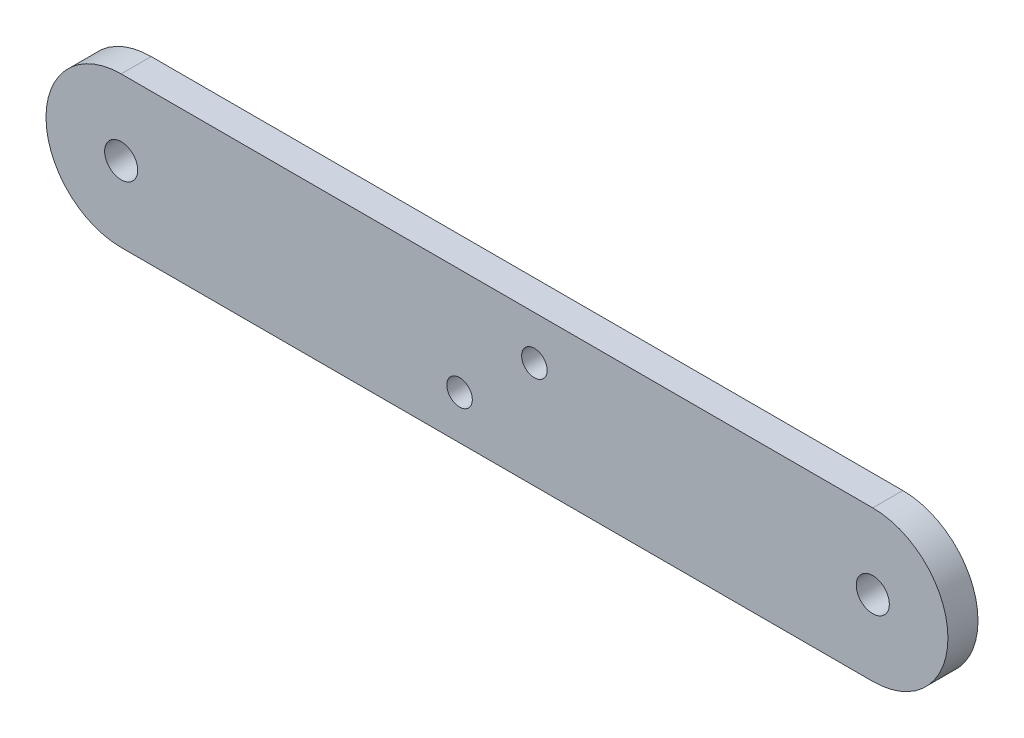
ISO-10303-21;
HEADER;
FILE_DESCRIPTION(('STEP AP214'),'2;1');
FILE_NAME('part.step','',(''),(''),'','','');
FILE_SCHEMA(('AUTOMOTIVE_DESIGN { 1 0 10303 214 1 1 1 1 }'));
ENDSEC;
DATA;
#1=APPLICATION_CONTEXT('core data for automotive mechanical design processes');
#2=APPLICATION_PROTOCOL_DEFINITION('international standard','automotive_design',2000,#1);
#3=PRODUCT_CONTEXT('',#1,'mechanical');
#4=PRODUCT('Part','Part','',(#3));
#5=PRODUCT_RELATED_PRODUCT_CATEGORY('part','',(#4));
#6=PRODUCT_DEFINITION_FORMATION('','',#4);
#7=PRODUCT_DEFINITION_CONTEXT('part definition',#1,'design');
#8=PRODUCT_DEFINITION('design','',#6,#7);
#9=PRODUCT_DEFINITION_SHAPE('','',#8);
#10=(LENGTH_UNIT() NAMED_UNIT(*) SI_UNIT(.MILLI.,.METRE.));
#11=(NAMED_UNIT(*) PLANE_ANGLE_UNIT() SI_UNIT($,.RADIAN.));
#12=(NAMED_UNIT(*) SI_UNIT($,.STERADIAN.) SOLID_ANGLE_UNIT());
#13=UNCERTAINTY_MEASURE_WITH_UNIT(LENGTH_MEASURE(1.E-05),#10,'distance_accuracy_value','');
#14=(GEOMETRIC_REPRESENTATION_CONTEXT(3) GLOBAL_UNCERTAINTY_ASSIGNED_CONTEXT((#13)) GLOBAL_UNIT_ASSIGNED_CONTEXT((#10,
#11,#12)) REPRESENTATION_CONTEXT('',''));
#15=CARTESIAN_POINT('',(0.,0.,0.));
#16=DIRECTION('',(0.,0.,1.));
#17=DIRECTION('',(1.,0.,0.));
#18=AXIS2_PLACEMENT_3D('',#15,#16,#17);
#19=CARTESIAN_POINT('',(0.,0.,4.));
#20=DIRECTION('',(0.,0.,1.));
#21=DIRECTION('',(1.,0.,0.));
#22=AXIS2_PLACEMENT_3D('',#19,#20,#21);
#23=PLANE('',#22);
#24=CARTESIAN_POINT('',(54.9792888802734,4.17811946296252,4.));
#25=DIRECTION('',(0.,0.,1.));
#26=DIRECTION('',(1.,0.,0.));
#27=AXIS2_PLACEMENT_3D('',#24,#25,#26);
#28=CIRCLE('',#27,1.7);
#29=CARTESIAN_POINT('',(56.6792888802734,4.17811946296252,4.));
#30=VERTEX_POINT('',#29);
#31=EDGE_CURVE('E125',#30,#30,#28,.T.);
#32=ORIENTED_EDGE('',*,*,#31,.F.);
#33=EDGE_LOOP('',(#32));
#34=FACE_BOUND('',#33,.T.);
#35=CARTESIAN_POINT('',(0.,0.,4.));
#36=DIRECTION('',(0.,0.,1.));
#37=DIRECTION('',(1.,0.,0.));
#38=AXIS2_PLACEMENT_3D('',#35,#36,#37);
#39=CIRCLE('',#38,2.2);
#40=CARTESIAN_POINT('',(2.2,0.,4.));
#41=VERTEX_POINT('',#40);
#42=EDGE_CURVE('E104',#41,#41,#39,.T.);
#43=ORIENTED_EDGE('',*,*,#42,.F.);
#44=EDGE_LOOP('',(#43));
#45=FACE_BOUND('',#44,.T.);
#46=CARTESIAN_POINT('',(0.,0.,4.));
#47=DIRECTION('',(0.,0.,1.));
#48=DIRECTION('',(1.,0.,0.));
#49=AXIS2_PLACEMENT_3D('',#46,#47,#48);
#50=CIRCLE('',#49,10.);
#51=CARTESIAN_POINT('',(0.,10.,4.));
#52=VERTEX_POINT('',#51);
#53=CARTESIAN_POINT('',(0.,-10.,4.));
#54=VERTEX_POINT('',#53);
#55=EDGE_CURVE('E89',#52,#54,#50,.T.);
#56=ORIENTED_EDGE('',*,*,#55,.T.);
#57=DIRECTION('',(1.,0.,0.));
#58=VECTOR('',#57,1.);
#59=CARTESIAN_POINT('',(0.,-10.,4.));
#60=LINE('',#59,#58);
#61=CARTESIAN_POINT('',(100.,-10.,4.));
#62=VERTEX_POINT('',#61);
#63=EDGE_CURVE('E84',#54,#62,#60,.T.);
#64=ORIENTED_EDGE('',*,*,#63,.T.);
#65=CARTESIAN_POINT('',(100.,0.,4.));
#66=DIRECTION('',(0.,0.,1.));
#67=DIRECTION('',(1.,0.,0.));
#68=AXIS2_PLACEMENT_3D('',#65,#66,#67);
#69=CIRCLE('',#68,10.);
#70=CARTESIAN_POINT('',(100.,10.,4.));
#71=VERTEX_POINT('',#70);
#72=EDGE_CURVE('E87',#62,#71,#69,.T.);
#73=ORIENTED_EDGE('',*,*,#72,.T.);
#74=DIRECTION('',(-1.,0.,0.));
#75=VECTOR('',#74,1.);
#76=CARTESIAN_POINT('',(0.,10.,4.));
#77=LINE('',#76,#75);
#78=EDGE_CURVE('E54',#71,#52,#77,.T.);
#79=ORIENTED_EDGE('',*,*,#78,.T.);
#80=EDGE_LOOP('',(#56,#64,#73,#79));
#81=FACE_BOUND('',#80,.T.);
#82=CARTESIAN_POINT('',(100.,0.,4.));
#83=DIRECTION('',(0.,0.,1.));
#84=DIRECTION('',(1.,0.,0.));
#85=AXIS2_PLACEMENT_3D('',#82,#83,#84);
#86=CIRCLE('',#85,2.2);
#87=CARTESIAN_POINT('',(102.2,0.,4.));
#88=VERTEX_POINT('',#87);
#89=EDGE_CURVE('E119',#88,#88,#86,.T.);
#90=ORIENTED_EDGE('',*,*,#89,.F.);
#91=EDGE_LOOP('',(#90));
#92=FACE_BOUND('',#91,.T.);
#93=CARTESIAN_POINT('',(45.0207111197266,-4.17811946296252,4.));
#94=DIRECTION('',(0.,0.,1.));
#95=DIRECTION('',(1.,0.,0.));
#96=AXIS2_PLACEMENT_3D('',#93,#94,#95);
#97=CIRCLE('',#96,1.7);
#98=CARTESIAN_POINT('',(46.7207111197267,-4.17811946296252,4.));
#99=VERTEX_POINT('',#98);
#100=EDGE_CURVE('E131',#99,#99,#97,.T.);
#101=ORIENTED_EDGE('',*,*,#100,.F.);
#102=EDGE_LOOP('',(#101));
#103=FACE_BOUND('',#102,.T.);
#104=ADVANCED_FACE('F37',(#34,#45,#81,#92,#103),#23,.T.);
#105=CARTESIAN_POINT('',(0.,0.,0.));
#106=DIRECTION('',(0.,0.,1.));
#107=DIRECTION('',(1.,0.,0.));
#108=AXIS2_PLACEMENT_3D('',#105,#106,#107);
#109=PLANE('',#108);
#110=CARTESIAN_POINT('',(0.,0.,0.));
#111=DIRECTION('',(0.,0.,1.));
#112=DIRECTION('',(1.,0.,0.));
#113=AXIS2_PLACEMENT_3D('',#110,#111,#112);
#114=CIRCLE('',#113,10.);
#115=CARTESIAN_POINT('',(0.,10.,0.));
#116=VERTEX_POINT('',#115);
#117=CARTESIAN_POINT('',(0.,-10.,0.));
#118=VERTEX_POINT('',#117);
#119=EDGE_CURVE('E101',#116,#118,#114,.T.);
#120=ORIENTED_EDGE('',*,*,#119,.F.);
#121=DIRECTION('',(-1.,0.,0.));
#122=VECTOR('',#121,1.);
#123=CARTESIAN_POINT('',(0.,10.,0.));
#124=LINE('',#123,#122);
#125=CARTESIAN_POINT('',(100.,10.,0.));
#126=VERTEX_POINT('',#125);
#127=EDGE_CURVE('E77',#126,#116,#124,.T.);
#128=ORIENTED_EDGE('',*,*,#127,.F.);
#129=CARTESIAN_POINT('',(100.,0.,0.));
#130=DIRECTION('',(0.,0.,1.));
#131=DIRECTION('',(1.,0.,0.));
#132=AXIS2_PLACEMENT_3D('',#129,#130,#131);
#133=CIRCLE('',#132,10.);
#134=CARTESIAN_POINT('',(100.,-10.,0.));
#135=VERTEX_POINT('',#134);
#136=EDGE_CURVE('E71',#135,#126,#133,.T.);
#137=ORIENTED_EDGE('',*,*,#136,.F.);
#138=DIRECTION('',(1.,0.,0.));
#139=VECTOR('',#138,1.);
#140=CARTESIAN_POINT('',(0.,-10.,0.));
#141=LINE('',#140,#139);
#142=EDGE_CURVE('E93',#118,#135,#141,.T.);
#143=ORIENTED_EDGE('',*,*,#142,.F.);
#144=EDGE_LOOP('',(#120,#128,#137,#143));
#145=FACE_BOUND('',#144,.T.);
#146=CARTESIAN_POINT('',(0.,0.,0.));
#147=DIRECTION('',(0.,0.,1.));
#148=DIRECTION('',(1.,0.,0.));
#149=AXIS2_PLACEMENT_3D('',#146,#147,#148);
#150=CIRCLE('',#149,2.2);
#151=CARTESIAN_POINT('',(2.2,0.,0.));
#152=VERTEX_POINT('',#151);
#153=EDGE_CURVE('E116',#152,#152,#150,.T.);
#154=ORIENTED_EDGE('',*,*,#153,.T.);
#155=EDGE_LOOP('',(#154));
#156=FACE_BOUND('',#155,.T.);
#157=CARTESIAN_POINT('',(100.,0.,0.));
#158=DIRECTION('',(0.,0.,1.));
#159=DIRECTION('',(1.,0.,0.));
#160=AXIS2_PLACEMENT_3D('',#157,#158,#159);
#161=CIRCLE('',#160,2.2);
#162=CARTESIAN_POINT('',(102.2,0.,0.));
#163=VERTEX_POINT('',#162);
#164=EDGE_CURVE('E122',#163,#163,#161,.T.);
#165=ORIENTED_EDGE('',*,*,#164,.T.);
#166=EDGE_LOOP('',(#165));
#167=FACE_BOUND('',#166,.T.);
#168=CARTESIAN_POINT('',(54.9792888802734,4.17811946296252,0.));
#169=DIRECTION('',(0.,0.,1.));
#170=DIRECTION('',(1.,0.,0.));
#171=AXIS2_PLACEMENT_3D('',#168,#169,#170);
#172=CIRCLE('',#171,1.7);
#173=CARTESIAN_POINT('',(56.6792888802734,4.17811946296252,0.));
#174=VERTEX_POINT('',#173);
#175=EDGE_CURVE('E128',#174,#174,#172,.T.);
#176=ORIENTED_EDGE('',*,*,#175,.T.);
#177=EDGE_LOOP('',(#176));
#178=FACE_BOUND('',#177,.T.);
#179=CARTESIAN_POINT('',(45.0207111197266,-4.17811946296252,0.));
#180=DIRECTION('',(0.,0.,1.));
#181=DIRECTION('',(1.,0.,0.));
#182=AXIS2_PLACEMENT_3D('',#179,#180,#181);
#183=CIRCLE('',#182,1.7);
#184=CARTESIAN_POINT('',(46.7207111197267,-4.17811946296252,0.));
#185=VERTEX_POINT('',#184);
#186=EDGE_CURVE('E134',#185,#185,#183,.T.);
#187=ORIENTED_EDGE('',*,*,#186,.T.);
#188=EDGE_LOOP('',(#187));
#189=FACE_BOUND('',#188,.T.);
#190=ADVANCED_FACE('F112',(#145,#156,#167,#178,#189),#109,.F.);
#191=CARTESIAN_POINT('',(0.,0.,4.));
#192=DIRECTION('',(0.,0.,-1.));
#193=DIRECTION('',(-1.,0.,0.));
#194=AXIS2_PLACEMENT_3D('',#191,#192,#193);
#195=CYLINDRICAL_SURFACE('',#194,10.);
#196=ORIENTED_EDGE('',*,*,#119,.T.);
#197=DIRECTION('',(0.,0.,-1.));
#198=VECTOR('',#197,1.);
#199=CARTESIAN_POINT('',(0.,-10.,4.));
#200=LINE('',#199,#198);
#201=EDGE_CURVE('E11',#54,#118,#200,.T.);
#202=ORIENTED_EDGE('',*,*,#201,.F.);
#203=ORIENTED_EDGE('',*,*,#55,.F.);
#204=DIRECTION('',(0.,0.,-1.));
#205=VECTOR('',#204,1.);
#206=CARTESIAN_POINT('',(0.,10.,4.));
#207=LINE('',#206,#205);
#208=EDGE_CURVE('E97',#52,#116,#207,.T.);
#209=ORIENTED_EDGE('',*,*,#208,.T.);
#210=EDGE_LOOP('',(#196,#202,#203,#209));
#211=FACE_BOUND('',#210,.T.);
#212=ADVANCED_FACE('F39',(#211),#195,.T.);
#213=CARTESIAN_POINT('',(0.,-10.,4.));
#214=DIRECTION('',(0.,1.,0.));
#215=DIRECTION('',(-1.,0.,0.));
#216=AXIS2_PLACEMENT_3D('',#213,#214,#215);
#217=PLANE('',#216);
#218=ORIENTED_EDGE('',*,*,#142,.T.);
#219=DIRECTION('',(0.,0.,-1.));
#220=VECTOR('',#219,1.);
#221=CARTESIAN_POINT('',(100.,-10.,4.));
#222=LINE('',#221,#220);
#223=EDGE_CURVE('E46',#62,#135,#222,.T.);
#224=ORIENTED_EDGE('',*,*,#223,.F.);
#225=ORIENTED_EDGE('',*,*,#63,.F.);
#226=ORIENTED_EDGE('',*,*,#201,.T.);
#227=EDGE_LOOP('',(#218,#224,#225,#226));
#228=FACE_BOUND('',#227,.T.);
#229=ADVANCED_FACE('F92',(#228),#217,.F.);
#230=CARTESIAN_POINT('',(100.,0.,4.));
#231=DIRECTION('',(0.,0.,-1.));
#232=DIRECTION('',(-1.,0.,0.));
#233=AXIS2_PLACEMENT_3D('',#230,#231,#232);
#234=CYLINDRICAL_SURFACE('',#233,10.);
#235=ORIENTED_EDGE('',*,*,#136,.T.);
#236=DIRECTION('',(0.,0.,-1.));
#237=VECTOR('',#236,1.);
#238=CARTESIAN_POINT('',(100.,10.,4.));
#239=LINE('',#238,#237);
#240=EDGE_CURVE('E94',#71,#126,#239,.T.);
#241=ORIENTED_EDGE('',*,*,#240,.F.);
#242=ORIENTED_EDGE('',*,*,#72,.F.);
#243=ORIENTED_EDGE('',*,*,#223,.T.);
#244=EDGE_LOOP('',(#235,#241,#242,#243));
#245=FACE_BOUND('',#244,.T.);
#246=ADVANCED_FACE('F95',(#245),#234,.T.);
#247=CARTESIAN_POINT('',(0.,10.,4.));
#248=DIRECTION('',(0.,-1.,0.));
#249=DIRECTION('',(1.,0.,0.));
#250=AXIS2_PLACEMENT_3D('',#247,#248,#249);
#251=PLANE('',#250);
#252=ORIENTED_EDGE('',*,*,#127,.T.);
#253=ORIENTED_EDGE('',*,*,#208,.F.);
#254=ORIENTED_EDGE('',*,*,#78,.F.);
#255=ORIENTED_EDGE('',*,*,#240,.T.);
#256=EDGE_LOOP('',(#252,#253,#254,#255));
#257=FACE_BOUND('',#256,.T.);
#258=ADVANCED_FACE('F109',(#257),#251,.F.);
#259=CARTESIAN_POINT('',(0.,0.,4.));
#260=DIRECTION('',(0.,0.,-1.));
#261=DIRECTION('',(-1.,0.,0.));
#262=AXIS2_PLACEMENT_3D('',#259,#260,#261);
#263=CYLINDRICAL_SURFACE('',#262,2.2);
#264=ORIENTED_EDGE('',*,*,#42,.T.);
#265=EDGE_LOOP('',(#264));
#266=FACE_BOUND('',#265,.T.);
#267=ORIENTED_EDGE('',*,*,#153,.F.);
#268=EDGE_LOOP('',(#267));
#269=FACE_BOUND('',#268,.T.);
#270=ADVANCED_FACE('F153',(#266,#269),#263,.F.);
#271=CARTESIAN_POINT('',(100.,0.,4.));
#272=DIRECTION('',(0.,0.,-1.));
#273=DIRECTION('',(-1.,0.,0.));
#274=AXIS2_PLACEMENT_3D('',#271,#272,#273);
#275=CYLINDRICAL_SURFACE('',#274,2.2);
#276=ORIENTED_EDGE('',*,*,#89,.T.);
#277=EDGE_LOOP('',(#276));
#278=FACE_BOUND('',#277,.T.);
#279=ORIENTED_EDGE('',*,*,#164,.F.);
#280=EDGE_LOOP('',(#279));
#281=FACE_BOUND('',#280,.T.);
#282=ADVANCED_FACE('F199',(#278,#281),#275,.F.);
#283=CARTESIAN_POINT('',(54.9792888802734,4.17811946296252,4.));
#284=DIRECTION('',(0.,0.,-1.));
#285=DIRECTION('',(-1.,0.,0.));
#286=AXIS2_PLACEMENT_3D('',#283,#284,#285);
#287=CYLINDRICAL_SURFACE('',#286,1.7);
#288=ORIENTED_EDGE('',*,*,#31,.T.);
#289=EDGE_LOOP('',(#288));
#290=FACE_BOUND('',#289,.T.);
#291=ORIENTED_EDGE('',*,*,#175,.F.);
#292=EDGE_LOOP('',(#291));
#293=FACE_BOUND('',#292,.T.);
#294=ADVANCED_FACE('F207',(#290,#293),#287,.F.);
#295=CARTESIAN_POINT('',(45.0207111197266,-4.17811946296252,4.));
#296=DIRECTION('',(0.,0.,-1.));
#297=DIRECTION('',(-1.,0.,0.));
#298=AXIS2_PLACEMENT_3D('',#295,#296,#297);
#299=CYLINDRICAL_SURFACE('',#298,1.7);
#300=ORIENTED_EDGE('',*,*,#100,.T.);
#301=EDGE_LOOP('',(#300));
#302=FACE_BOUND('',#301,.T.);
#303=ORIENTED_EDGE('',*,*,#186,.F.);
#304=EDGE_LOOP('',(#303));
#305=FACE_BOUND('',#304,.T.);
#306=ADVANCED_FACE('F140',(#302,#305),#299,.F.);
#307=CLOSED_SHELL('',(#104,#190,#212,#229,#246,#258,#270,#282,#294,#306));
#308=MANIFOLD_SOLID_BREP('B2',#307);
#309=ADVANCED_BREP_SHAPE_REPRESENTATION('',(#18,#308),#14);
#310=SHAPE_DEFINITION_REPRESENTATION(#9,#309);
ENDSEC;
END-ISO-10303-21;
